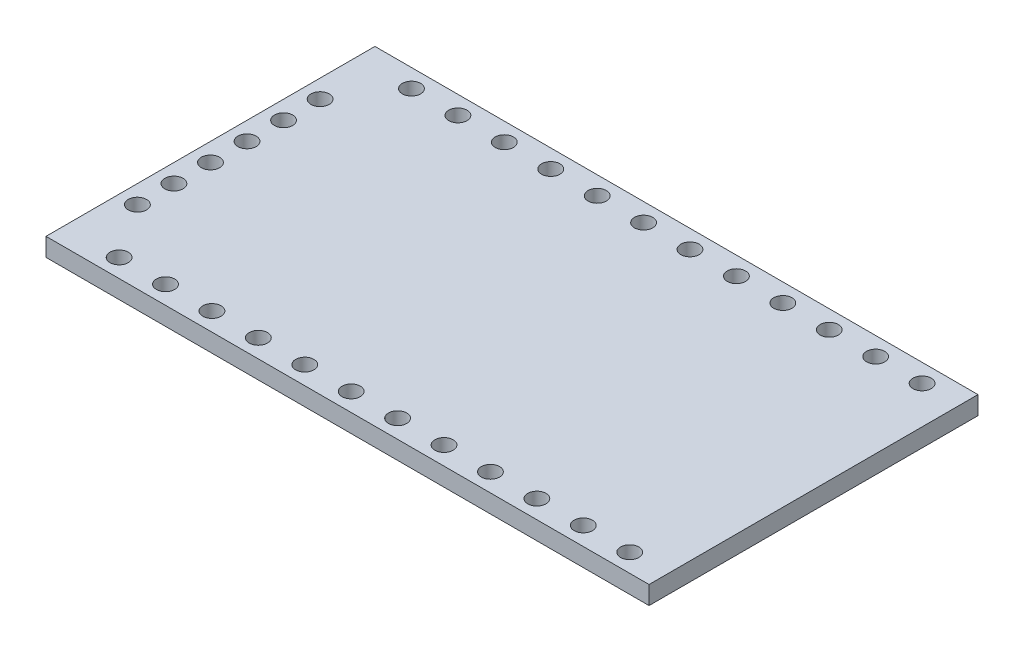
ISO-10303-21;
HEADER;
FILE_DESCRIPTION(('STEP AP214'),'2;1');
FILE_NAME('part.step','',(''),(''),'','','');
FILE_SCHEMA(('AUTOMOTIVE_DESIGN { 1 0 10303 214 1 1 1 1 }'));
ENDSEC;
DATA;
#1=APPLICATION_CONTEXT('core data for automotive mechanical design processes');
#2=APPLICATION_PROTOCOL_DEFINITION('international standard','automotive_design',2000,#1);
#3=PRODUCT_CONTEXT('',#1,'mechanical');
#4=PRODUCT('Part','Part','',(#3));
#5=PRODUCT_RELATED_PRODUCT_CATEGORY('part','',(#4));
#6=PRODUCT_DEFINITION_FORMATION('','',#4);
#7=PRODUCT_DEFINITION_CONTEXT('part definition',#1,'design');
#8=PRODUCT_DEFINITION('design','',#6,#7);
#9=PRODUCT_DEFINITION_SHAPE('','',#8);
#10=(LENGTH_UNIT() NAMED_UNIT(*) SI_UNIT(.MILLI.,.METRE.));
#11=(NAMED_UNIT(*) PLANE_ANGLE_UNIT() SI_UNIT($,.RADIAN.));
#12=(NAMED_UNIT(*) SI_UNIT($,.STERADIAN.) SOLID_ANGLE_UNIT());
#13=UNCERTAINTY_MEASURE_WITH_UNIT(LENGTH_MEASURE(1.E-05),#10,'distance_accuracy_value','');
#14=(GEOMETRIC_REPRESENTATION_CONTEXT(3) GLOBAL_UNCERTAINTY_ASSIGNED_CONTEXT((#13)) GLOBAL_UNIT_ASSIGNED_CONTEXT((#10,
#11,#12)) REPRESENTATION_CONTEXT('',''));
#15=CARTESIAN_POINT('',(0.,0.,0.));
#16=DIRECTION('',(0.,0.,1.));
#17=DIRECTION('',(1.,0.,0.));
#18=AXIS2_PLACEMENT_3D('',#15,#16,#17);
#19=CARTESIAN_POINT('',(0.,1.,0.));
#20=DIRECTION('',(0.,-1.,0.));
#21=DIRECTION('',(0.,0.,-1.));
#22=AXIS2_PLACEMENT_3D('',#19,#20,#21);
#23=PLANE('',#22);
#24=DIRECTION('',(-1.,0.,0.));
#25=VECTOR('',#24,1.);
#26=CARTESIAN_POINT('',(-23.6384959143146,1.,-9.));
#27=LINE('',#26,#25);
#28=CARTESIAN_POINT('',(9.36150408568536,1.,-9.));
#29=VERTEX_POINT('',#28);
#30=CARTESIAN_POINT('',(-23.6384959143146,1.,-9.));
#31=VERTEX_POINT('',#30);
#32=EDGE_CURVE('E84',#29,#31,#27,.T.);
#33=ORIENTED_EDGE('',*,*,#32,.T.);
#34=DIRECTION('',(0.,0.,1.));
#35=VECTOR('',#34,1.);
#36=CARTESIAN_POINT('',(-23.6384959143146,1.,9.));
#37=LINE('',#36,#35);
#38=CARTESIAN_POINT('',(-23.6384959143146,1.,9.));
#39=VERTEX_POINT('',#38);
#40=EDGE_CURVE('E79',#31,#39,#37,.T.);
#41=ORIENTED_EDGE('',*,*,#40,.T.);
#42=DIRECTION('',(1.,0.,0.));
#43=VECTOR('',#42,1.);
#44=CARTESIAN_POINT('',(-23.6384959143146,1.,9.));
#45=LINE('',#44,#43);
#46=CARTESIAN_POINT('',(9.36150408568536,1.,9.));
#47=VERTEX_POINT('',#46);
#48=EDGE_CURVE('E82',#39,#47,#45,.T.);
#49=ORIENTED_EDGE('',*,*,#48,.T.);
#50=DIRECTION('',(0.,0.,-1.));
#51=VECTOR('',#50,1.);
#52=CARTESIAN_POINT('',(9.36150408568536,1.,-9.));
#53=LINE('',#52,#51);
#54=EDGE_CURVE('E49',#47,#29,#53,.T.);
#55=ORIENTED_EDGE('',*,*,#54,.T.);
#56=EDGE_LOOP('',(#33,#41,#49,#55));
#57=FACE_BOUND('',#56,.T.);
#58=CARTESIAN_POINT('',(-22.6384959143146,1.,-1.));
#59=DIRECTION('',(0.,1.,0.));
#60=DIRECTION('',(0.,0.,1.));
#61=AXIS2_PLACEMENT_3D('',#58,#59,#60);
#62=CIRCLE('',#61,0.499999999999999);
#63=CARTESIAN_POINT('',(-22.6384959143146,1.,-0.500000000000001));
#64=VERTEX_POINT('',#63);
#65=EDGE_CURVE('E99',#64,#64,#62,.T.);
#66=ORIENTED_EDGE('',*,*,#65,.F.);
#67=EDGE_LOOP('',(#66));
#68=FACE_BOUND('',#67,.T.);
#69=CARTESIAN_POINT('',(-20.6384959143147,1.,-8.));
#70=DIRECTION('',(0.,1.,0.));
#71=DIRECTION('',(0.,0.,1.));
#72=AXIS2_PLACEMENT_3D('',#69,#70,#71);
#73=CIRCLE('',#72,0.499999999999999);
#74=CARTESIAN_POINT('',(-20.6384959143147,1.,-7.5));
#75=VERTEX_POINT('',#74);
#76=EDGE_CURVE('E114',#75,#75,#73,.T.);
#77=ORIENTED_EDGE('',*,*,#76,.F.);
#78=EDGE_LOOP('',(#77));
#79=FACE_BOUND('',#78,.T.);
#80=CARTESIAN_POINT('',(-22.6384959143146,1.,-3.));
#81=DIRECTION('',(0.,1.,0.));
#82=DIRECTION('',(0.,0.,1.));
#83=AXIS2_PLACEMENT_3D('',#80,#81,#82);
#84=CIRCLE('',#83,0.499999999999999);
#85=CARTESIAN_POINT('',(-22.6384959143146,1.,-2.5));
#86=VERTEX_POINT('',#85);
#87=EDGE_CURVE('E120',#86,#86,#84,.T.);
#88=ORIENTED_EDGE('',*,*,#87,.F.);
#89=EDGE_LOOP('',(#88));
#90=FACE_BOUND('',#89,.T.);
#91=CARTESIAN_POINT('',(-22.6384959143147,1.,-5.));
#92=DIRECTION('',(0.,1.,0.));
#93=DIRECTION('',(0.,0.,1.));
#94=AXIS2_PLACEMENT_3D('',#91,#92,#93);
#95=CIRCLE('',#94,0.499999999999999);
#96=CARTESIAN_POINT('',(-22.6384959143147,1.,-4.5));
#97=VERTEX_POINT('',#96);
#98=EDGE_CURVE('E126',#97,#97,#95,.T.);
#99=ORIENTED_EDGE('',*,*,#98,.F.);
#100=EDGE_LOOP('',(#99));
#101=FACE_BOUND('',#100,.T.);
#102=CARTESIAN_POINT('',(7.30150408568535,1.,8.));
#103=DIRECTION('',(0.,1.,0.));
#104=DIRECTION('',(0.,0.,-1.));
#105=AXIS2_PLACEMENT_3D('',#102,#103,#104);
#106=CIRCLE('',#105,0.499999999999999);
#107=CARTESIAN_POINT('',(7.30150408568535,1.,7.5));
#108=VERTEX_POINT('',#107);
#109=EDGE_CURVE('E132',#108,#108,#106,.T.);
#110=ORIENTED_EDGE('',*,*,#109,.F.);
#111=EDGE_LOOP('',(#110));
#112=FACE_BOUND('',#111,.T.);
#113=CARTESIAN_POINT('',(-18.0984959143147,1.,-8.));
#114=DIRECTION('',(0.,1.,0.));
#115=DIRECTION('',(0.,0.,1.));
#116=AXIS2_PLACEMENT_3D('',#113,#114,#115);
#117=CIRCLE('',#116,0.499999999999999);
#118=CARTESIAN_POINT('',(-18.0984959143147,1.,-7.5));
#119=VERTEX_POINT('',#118);
#120=EDGE_CURVE('E138',#119,#119,#117,.T.);
#121=ORIENTED_EDGE('',*,*,#120,.F.);
#122=EDGE_LOOP('',(#121));
#123=FACE_BOUND('',#122,.T.);
#124=CARTESIAN_POINT('',(-15.5584959143146,1.,-8.));
#125=DIRECTION('',(0.,1.,0.));
#126=DIRECTION('',(0.,0.,1.));
#127=AXIS2_PLACEMENT_3D('',#124,#125,#126);
#128=CIRCLE('',#127,0.499999999999999);
#129=CARTESIAN_POINT('',(-15.5584959143146,1.,-7.5));
#130=VERTEX_POINT('',#129);
#131=EDGE_CURVE('E144',#130,#130,#128,.T.);
#132=ORIENTED_EDGE('',*,*,#131,.F.);
#133=EDGE_LOOP('',(#132));
#134=FACE_BOUND('',#133,.T.);
#135=CARTESIAN_POINT('',(-13.0184959143147,1.,-8.));
#136=DIRECTION('',(0.,1.,0.));
#137=DIRECTION('',(0.,0.,1.));
#138=AXIS2_PLACEMENT_3D('',#135,#136,#137);
#139=CIRCLE('',#138,0.499999999999999);
#140=CARTESIAN_POINT('',(-13.0184959143147,1.,-7.5));
#141=VERTEX_POINT('',#140);
#142=EDGE_CURVE('E150',#141,#141,#139,.T.);
#143=ORIENTED_EDGE('',*,*,#142,.F.);
#144=EDGE_LOOP('',(#143));
#145=FACE_BOUND('',#144,.T.);
#146=CARTESIAN_POINT('',(-10.4784959143147,1.,-8.));
#147=DIRECTION('',(0.,1.,0.));
#148=DIRECTION('',(0.,0.,1.));
#149=AXIS2_PLACEMENT_3D('',#146,#147,#148);
#150=CIRCLE('',#149,0.499999999999999);
#151=CARTESIAN_POINT('',(-10.4784959143147,1.,-7.5));
#152=VERTEX_POINT('',#151);
#153=EDGE_CURVE('E156',#152,#152,#150,.T.);
#154=ORIENTED_EDGE('',*,*,#153,.F.);
#155=EDGE_LOOP('',(#154));
#156=FACE_BOUND('',#155,.T.);
#157=CARTESIAN_POINT('',(-7.93849591431465,1.,-8.));
#158=DIRECTION('',(0.,1.,0.));
#159=DIRECTION('',(0.,0.,1.));
#160=AXIS2_PLACEMENT_3D('',#157,#158,#159);
#161=CIRCLE('',#160,0.499999999999999);
#162=CARTESIAN_POINT('',(-7.93849591431465,1.,-7.5));
#163=VERTEX_POINT('',#162);
#164=EDGE_CURVE('E162',#163,#163,#161,.T.);
#165=ORIENTED_EDGE('',*,*,#164,.F.);
#166=EDGE_LOOP('',(#165));
#167=FACE_BOUND('',#166,.T.);
#168=CARTESIAN_POINT('',(-5.39849591431465,1.,-8.));
#169=DIRECTION('',(0.,1.,0.));
#170=DIRECTION('',(0.,0.,1.));
#171=AXIS2_PLACEMENT_3D('',#168,#169,#170);
#172=CIRCLE('',#171,0.499999999999999);
#173=CARTESIAN_POINT('',(-5.39849591431465,1.,-7.5));
#174=VERTEX_POINT('',#173);
#175=EDGE_CURVE('E168',#174,#174,#172,.T.);
#176=ORIENTED_EDGE('',*,*,#175,.F.);
#177=EDGE_LOOP('',(#176));
#178=FACE_BOUND('',#177,.T.);
#179=CARTESIAN_POINT('',(-2.85849591431465,1.,-8.));
#180=DIRECTION('',(0.,1.,0.));
#181=DIRECTION('',(0.,0.,1.));
#182=AXIS2_PLACEMENT_3D('',#179,#180,#181);
#183=CIRCLE('',#182,0.499999999999999);
#184=CARTESIAN_POINT('',(-2.85849591431465,1.,-7.5));
#185=VERTEX_POINT('',#184);
#186=EDGE_CURVE('E174',#185,#185,#183,.T.);
#187=ORIENTED_EDGE('',*,*,#186,.F.);
#188=EDGE_LOOP('',(#187));
#189=FACE_BOUND('',#188,.T.);
#190=CARTESIAN_POINT('',(-0.31849591431465,1.,-8.));
#191=DIRECTION('',(0.,1.,0.));
#192=DIRECTION('',(0.,0.,1.));
#193=AXIS2_PLACEMENT_3D('',#190,#191,#192);
#194=CIRCLE('',#193,0.499999999999999);
#195=CARTESIAN_POINT('',(-0.31849591431465,1.,-7.5));
#196=VERTEX_POINT('',#195);
#197=EDGE_CURVE('E180',#196,#196,#194,.T.);
#198=ORIENTED_EDGE('',*,*,#197,.F.);
#199=EDGE_LOOP('',(#198));
#200=FACE_BOUND('',#199,.T.);
#201=CARTESIAN_POINT('',(2.22150408568535,1.,-8.));
#202=DIRECTION('',(0.,1.,0.));
#203=DIRECTION('',(0.,0.,1.));
#204=AXIS2_PLACEMENT_3D('',#201,#202,#203);
#205=CIRCLE('',#204,0.499999999999999);
#206=CARTESIAN_POINT('',(2.22150408568535,1.,-7.5));
#207=VERTEX_POINT('',#206);
#208=EDGE_CURVE('E186',#207,#207,#205,.T.);
#209=ORIENTED_EDGE('',*,*,#208,.F.);
#210=EDGE_LOOP('',(#209));
#211=FACE_BOUND('',#210,.T.);
#212=CARTESIAN_POINT('',(4.76150408568535,1.,-8.));
#213=DIRECTION('',(0.,1.,0.));
#214=DIRECTION('',(0.,0.,1.));
#215=AXIS2_PLACEMENT_3D('',#212,#213,#214);
#216=CIRCLE('',#215,0.499999999999999);
#217=CARTESIAN_POINT('',(4.76150408568535,1.,-7.5));
#218=VERTEX_POINT('',#217);
#219=EDGE_CURVE('E192',#218,#218,#216,.T.);
#220=ORIENTED_EDGE('',*,*,#219,.F.);
#221=EDGE_LOOP('',(#220));
#222=FACE_BOUND('',#221,.T.);
#223=CARTESIAN_POINT('',(7.30150408568535,1.,-8.));
#224=DIRECTION('',(0.,1.,0.));
#225=DIRECTION('',(0.,0.,1.));
#226=AXIS2_PLACEMENT_3D('',#223,#224,#225);
#227=CIRCLE('',#226,0.499999999999999);
#228=CARTESIAN_POINT('',(7.30150408568535,1.,-7.5));
#229=VERTEX_POINT('',#228);
#230=EDGE_CURVE('E198',#229,#229,#227,.T.);
#231=ORIENTED_EDGE('',*,*,#230,.F.);
#232=EDGE_LOOP('',(#231));
#233=FACE_BOUND('',#232,.T.);
#234=CARTESIAN_POINT('',(4.76150408568535,1.,8.));
#235=DIRECTION('',(0.,1.,0.));
#236=DIRECTION('',(0.,0.,-1.));
#237=AXIS2_PLACEMENT_3D('',#234,#235,#236);
#238=CIRCLE('',#237,0.499999999999999);
#239=CARTESIAN_POINT('',(4.76150408568535,1.,7.5));
#240=VERTEX_POINT('',#239);
#241=EDGE_CURVE('E204',#240,#240,#238,.T.);
#242=ORIENTED_EDGE('',*,*,#241,.F.);
#243=EDGE_LOOP('',(#242));
#244=FACE_BOUND('',#243,.T.);
#245=CARTESIAN_POINT('',(2.22150408568535,1.,8.));
#246=DIRECTION('',(0.,1.,0.));
#247=DIRECTION('',(0.,0.,-1.));
#248=AXIS2_PLACEMENT_3D('',#245,#246,#247);
#249=CIRCLE('',#248,0.499999999999999);
#250=CARTESIAN_POINT('',(2.22150408568535,1.,7.5));
#251=VERTEX_POINT('',#250);
#252=EDGE_CURVE('E210',#251,#251,#249,.T.);
#253=ORIENTED_EDGE('',*,*,#252,.F.);
#254=EDGE_LOOP('',(#253));
#255=FACE_BOUND('',#254,.T.);
#256=CARTESIAN_POINT('',(-0.31849591431465,1.,8.));
#257=DIRECTION('',(0.,1.,0.));
#258=DIRECTION('',(0.,0.,-1.));
#259=AXIS2_PLACEMENT_3D('',#256,#257,#258);
#260=CIRCLE('',#259,0.499999999999999);
#261=CARTESIAN_POINT('',(-0.31849591431465,1.,7.5));
#262=VERTEX_POINT('',#261);
#263=EDGE_CURVE('E216',#262,#262,#260,.T.);
#264=ORIENTED_EDGE('',*,*,#263,.F.);
#265=EDGE_LOOP('',(#264));
#266=FACE_BOUND('',#265,.T.);
#267=CARTESIAN_POINT('',(-2.85849591431465,1.,8.));
#268=DIRECTION('',(0.,1.,0.));
#269=DIRECTION('',(0.,0.,-1.));
#270=AXIS2_PLACEMENT_3D('',#267,#268,#269);
#271=CIRCLE('',#270,0.499999999999999);
#272=CARTESIAN_POINT('',(-2.85849591431465,1.,7.5));
#273=VERTEX_POINT('',#272);
#274=EDGE_CURVE('E222',#273,#273,#271,.T.);
#275=ORIENTED_EDGE('',*,*,#274,.F.);
#276=EDGE_LOOP('',(#275));
#277=FACE_BOUND('',#276,.T.);
#278=CARTESIAN_POINT('',(-5.39849591431465,1.,8.));
#279=DIRECTION('',(0.,1.,0.));
#280=DIRECTION('',(0.,0.,-1.));
#281=AXIS2_PLACEMENT_3D('',#278,#279,#280);
#282=CIRCLE('',#281,0.499999999999999);
#283=CARTESIAN_POINT('',(-5.39849591431465,1.,7.5));
#284=VERTEX_POINT('',#283);
#285=EDGE_CURVE('E228',#284,#284,#282,.T.);
#286=ORIENTED_EDGE('',*,*,#285,.F.);
#287=EDGE_LOOP('',(#286));
#288=FACE_BOUND('',#287,.T.);
#289=CARTESIAN_POINT('',(-7.93849591431465,1.,8.));
#290=DIRECTION('',(0.,1.,0.));
#291=DIRECTION('',(0.,0.,-1.));
#292=AXIS2_PLACEMENT_3D('',#289,#290,#291);
#293=CIRCLE('',#292,0.499999999999999);
#294=CARTESIAN_POINT('',(-7.93849591431465,1.,7.5));
#295=VERTEX_POINT('',#294);
#296=EDGE_CURVE('E234',#295,#295,#293,.T.);
#297=ORIENTED_EDGE('',*,*,#296,.F.);
#298=EDGE_LOOP('',(#297));
#299=FACE_BOUND('',#298,.T.);
#300=CARTESIAN_POINT('',(-10.4784959143147,1.,8.));
#301=DIRECTION('',(0.,1.,0.));
#302=DIRECTION('',(0.,0.,-1.));
#303=AXIS2_PLACEMENT_3D('',#300,#301,#302);
#304=CIRCLE('',#303,0.499999999999999);
#305=CARTESIAN_POINT('',(-10.4784959143147,1.,7.5));
#306=VERTEX_POINT('',#305);
#307=EDGE_CURVE('E240',#306,#306,#304,.T.);
#308=ORIENTED_EDGE('',*,*,#307,.F.);
#309=EDGE_LOOP('',(#308));
#310=FACE_BOUND('',#309,.T.);
#311=CARTESIAN_POINT('',(-13.0184959143147,1.,8.));
#312=DIRECTION('',(0.,1.,0.));
#313=DIRECTION('',(0.,0.,-1.));
#314=AXIS2_PLACEMENT_3D('',#311,#312,#313);
#315=CIRCLE('',#314,0.499999999999999);
#316=CARTESIAN_POINT('',(-13.0184959143147,1.,7.5));
#317=VERTEX_POINT('',#316);
#318=EDGE_CURVE('E246',#317,#317,#315,.T.);
#319=ORIENTED_EDGE('',*,*,#318,.F.);
#320=EDGE_LOOP('',(#319));
#321=FACE_BOUND('',#320,.T.);
#322=CARTESIAN_POINT('',(-15.5584959143146,1.,8.));
#323=DIRECTION('',(0.,1.,0.));
#324=DIRECTION('',(0.,0.,-1.));
#325=AXIS2_PLACEMENT_3D('',#322,#323,#324);
#326=CIRCLE('',#325,0.499999999999999);
#327=CARTESIAN_POINT('',(-15.5584959143146,1.,7.5));
#328=VERTEX_POINT('',#327);
#329=EDGE_CURVE('E252',#328,#328,#326,.T.);
#330=ORIENTED_EDGE('',*,*,#329,.F.);
#331=EDGE_LOOP('',(#330));
#332=FACE_BOUND('',#331,.T.);
#333=CARTESIAN_POINT('',(-18.0984959143147,1.,8.));
#334=DIRECTION('',(0.,1.,0.));
#335=DIRECTION('',(0.,0.,-1.));
#336=AXIS2_PLACEMENT_3D('',#333,#334,#335);
#337=CIRCLE('',#336,0.499999999999999);
#338=CARTESIAN_POINT('',(-18.0984959143147,1.,7.5));
#339=VERTEX_POINT('',#338);
#340=EDGE_CURVE('E258',#339,#339,#337,.T.);
#341=ORIENTED_EDGE('',*,*,#340,.F.);
#342=EDGE_LOOP('',(#341));
#343=FACE_BOUND('',#342,.T.);
#344=CARTESIAN_POINT('',(-20.6384959143147,1.,8.));
#345=DIRECTION('',(0.,1.,0.));
#346=DIRECTION('',(0.,0.,-1.));
#347=AXIS2_PLACEMENT_3D('',#344,#345,#346);
#348=CIRCLE('',#347,0.499999999999999);
#349=CARTESIAN_POINT('',(-20.6384959143147,1.,7.5));
#350=VERTEX_POINT('',#349);
#351=EDGE_CURVE('E264',#350,#350,#348,.T.);
#352=ORIENTED_EDGE('',*,*,#351,.F.);
#353=EDGE_LOOP('',(#352));
#354=FACE_BOUND('',#353,.T.);
#355=CARTESIAN_POINT('',(-22.6384959143147,1.,5.));
#356=DIRECTION('',(0.,1.,0.));
#357=DIRECTION('',(0.,0.,-1.));
#358=AXIS2_PLACEMENT_3D('',#355,#356,#357);
#359=CIRCLE('',#358,0.499999999999999);
#360=CARTESIAN_POINT('',(-22.6384959143147,1.,4.5));
#361=VERTEX_POINT('',#360);
#362=EDGE_CURVE('E270',#361,#361,#359,.T.);
#363=ORIENTED_EDGE('',*,*,#362,.F.);
#364=EDGE_LOOP('',(#363));
#365=FACE_BOUND('',#364,.T.);
#366=CARTESIAN_POINT('',(-22.6384959143146,1.,3.));
#367=DIRECTION('',(0.,1.,0.));
#368=DIRECTION('',(0.,0.,-1.));
#369=AXIS2_PLACEMENT_3D('',#366,#367,#368);
#370=CIRCLE('',#369,0.499999999999999);
#371=CARTESIAN_POINT('',(-22.6384959143146,1.,2.5));
#372=VERTEX_POINT('',#371);
#373=EDGE_CURVE('E276',#372,#372,#370,.T.);
#374=ORIENTED_EDGE('',*,*,#373,.F.);
#375=EDGE_LOOP('',(#374));
#376=FACE_BOUND('',#375,.T.);
#377=CARTESIAN_POINT('',(-22.6384959143146,1.,1.));
#378=DIRECTION('',(0.,1.,0.));
#379=DIRECTION('',(0.,0.,-1.));
#380=AXIS2_PLACEMENT_3D('',#377,#378,#379);
#381=CIRCLE('',#380,0.499999999999999);
#382=CARTESIAN_POINT('',(-22.6384959143146,1.,0.500000000000001));
#383=VERTEX_POINT('',#382);
#384=EDGE_CURVE('E282',#383,#383,#381,.T.);
#385=ORIENTED_EDGE('',*,*,#384,.F.);
#386=EDGE_LOOP('',(#385));
#387=FACE_BOUND('',#386,.T.);
#388=ADVANCED_FACE('F32',(#57,#68,#79,#90,#101,#112,#123,#134,#145,#156,#167,#178,#189,#200,
#211,#222,#233,#244,#255,#266,#277,#288,#299,#310,#321,#332,#343,#354,#365,#376,#387),#23,.F.);
#389=CARTESIAN_POINT('',(0.,0.,0.));
#390=DIRECTION('',(0.,-1.,0.));
#391=DIRECTION('',(0.,0.,-1.));
#392=AXIS2_PLACEMENT_3D('',#389,#390,#391);
#393=PLANE('',#392);
#394=CARTESIAN_POINT('',(-22.6384959143146,0.,3.));
#395=DIRECTION('',(0.,1.,0.));
#396=DIRECTION('',(0.,0.,-1.));
#397=AXIS2_PLACEMENT_3D('',#394,#395,#396);
#398=CIRCLE('',#397,0.499999999999999);
#399=CARTESIAN_POINT('',(-22.6384959143146,0.,2.5));
#400=VERTEX_POINT('',#399);
#401=EDGE_CURVE('E279',#400,#400,#398,.T.);
#402=ORIENTED_EDGE('',*,*,#401,.T.);
#403=EDGE_LOOP('',(#402));
#404=FACE_BOUND('',#403,.T.);
#405=CARTESIAN_POINT('',(-20.6384959143147,0.,8.));
#406=DIRECTION('',(0.,1.,0.));
#407=DIRECTION('',(0.,0.,-1.));
#408=AXIS2_PLACEMENT_3D('',#405,#406,#407);
#409=CIRCLE('',#408,0.499999999999999);
#410=CARTESIAN_POINT('',(-20.6384959143147,0.,7.5));
#411=VERTEX_POINT('',#410);
#412=EDGE_CURVE('E267',#411,#411,#409,.T.);
#413=ORIENTED_EDGE('',*,*,#412,.T.);
#414=EDGE_LOOP('',(#413));
#415=FACE_BOUND('',#414,.T.);
#416=CARTESIAN_POINT('',(-15.5584959143146,0.,8.));
#417=DIRECTION('',(0.,1.,0.));
#418=DIRECTION('',(0.,0.,-1.));
#419=AXIS2_PLACEMENT_3D('',#416,#417,#418);
#420=CIRCLE('',#419,0.499999999999999);
#421=CARTESIAN_POINT('',(-15.5584959143146,0.,7.5));
#422=VERTEX_POINT('',#421);
#423=EDGE_CURVE('E255',#422,#422,#420,.T.);
#424=ORIENTED_EDGE('',*,*,#423,.T.);
#425=EDGE_LOOP('',(#424));
#426=FACE_BOUND('',#425,.T.);
#427=CARTESIAN_POINT('',(-10.4784959143147,0.,8.));
#428=DIRECTION('',(0.,1.,0.));
#429=DIRECTION('',(0.,0.,-1.));
#430=AXIS2_PLACEMENT_3D('',#427,#428,#429);
#431=CIRCLE('',#430,0.499999999999999);
#432=CARTESIAN_POINT('',(-10.4784959143147,0.,7.5));
#433=VERTEX_POINT('',#432);
#434=EDGE_CURVE('E243',#433,#433,#431,.T.);
#435=ORIENTED_EDGE('',*,*,#434,.T.);
#436=EDGE_LOOP('',(#435));
#437=FACE_BOUND('',#436,.T.);
#438=CARTESIAN_POINT('',(-5.39849591431465,0.,8.));
#439=DIRECTION('',(0.,1.,0.));
#440=DIRECTION('',(0.,0.,-1.));
#441=AXIS2_PLACEMENT_3D('',#438,#439,#440);
#442=CIRCLE('',#441,0.499999999999999);
#443=CARTESIAN_POINT('',(-5.39849591431465,0.,7.5));
#444=VERTEX_POINT('',#443);
#445=EDGE_CURVE('E231',#444,#444,#442,.T.);
#446=ORIENTED_EDGE('',*,*,#445,.T.);
#447=EDGE_LOOP('',(#446));
#448=FACE_BOUND('',#447,.T.);
#449=CARTESIAN_POINT('',(-0.31849591431465,0.,8.));
#450=DIRECTION('',(0.,1.,0.));
#451=DIRECTION('',(0.,0.,-1.));
#452=AXIS2_PLACEMENT_3D('',#449,#450,#451);
#453=CIRCLE('',#452,0.499999999999999);
#454=CARTESIAN_POINT('',(-0.31849591431465,0.,7.5));
#455=VERTEX_POINT('',#454);
#456=EDGE_CURVE('E219',#455,#455,#453,.T.);
#457=ORIENTED_EDGE('',*,*,#456,.T.);
#458=EDGE_LOOP('',(#457));
#459=FACE_BOUND('',#458,.T.);
#460=CARTESIAN_POINT('',(4.76150408568535,0.,8.));
#461=DIRECTION('',(0.,1.,0.));
#462=DIRECTION('',(0.,0.,-1.));
#463=AXIS2_PLACEMENT_3D('',#460,#461,#462);
#464=CIRCLE('',#463,0.499999999999999);
#465=CARTESIAN_POINT('',(4.76150408568535,0.,7.5));
#466=VERTEX_POINT('',#465);
#467=EDGE_CURVE('E207',#466,#466,#464,.T.);
#468=ORIENTED_EDGE('',*,*,#467,.T.);
#469=EDGE_LOOP('',(#468));
#470=FACE_BOUND('',#469,.T.);
#471=CARTESIAN_POINT('',(4.76150408568535,0.,-8.));
#472=DIRECTION('',(0.,1.,0.));
#473=DIRECTION('',(0.,0.,1.));
#474=AXIS2_PLACEMENT_3D('',#471,#472,#473);
#475=CIRCLE('',#474,0.499999999999999);
#476=CARTESIAN_POINT('',(4.76150408568535,0.,-7.5));
#477=VERTEX_POINT('',#476);
#478=EDGE_CURVE('E195',#477,#477,#475,.T.);
#479=ORIENTED_EDGE('',*,*,#478,.T.);
#480=EDGE_LOOP('',(#479));
#481=FACE_BOUND('',#480,.T.);
#482=CARTESIAN_POINT('',(-0.31849591431465,0.,-8.));
#483=DIRECTION('',(0.,1.,0.));
#484=DIRECTION('',(0.,0.,1.));
#485=AXIS2_PLACEMENT_3D('',#482,#483,#484);
#486=CIRCLE('',#485,0.499999999999999);
#487=CARTESIAN_POINT('',(-0.31849591431465,0.,-7.5));
#488=VERTEX_POINT('',#487);
#489=EDGE_CURVE('E183',#488,#488,#486,.T.);
#490=ORIENTED_EDGE('',*,*,#489,.T.);
#491=EDGE_LOOP('',(#490));
#492=FACE_BOUND('',#491,.T.);
#493=CARTESIAN_POINT('',(-5.39849591431465,0.,-8.));
#494=DIRECTION('',(0.,1.,0.));
#495=DIRECTION('',(0.,0.,1.));
#496=AXIS2_PLACEMENT_3D('',#493,#494,#495);
#497=CIRCLE('',#496,0.499999999999999);
#498=CARTESIAN_POINT('',(-5.39849591431465,0.,-7.5));
#499=VERTEX_POINT('',#498);
#500=EDGE_CURVE('E171',#499,#499,#497,.T.);
#501=ORIENTED_EDGE('',*,*,#500,.T.);
#502=EDGE_LOOP('',(#501));
#503=FACE_BOUND('',#502,.T.);
#504=CARTESIAN_POINT('',(-10.4784959143147,0.,-8.));
#505=DIRECTION('',(0.,1.,0.));
#506=DIRECTION('',(0.,0.,1.));
#507=AXIS2_PLACEMENT_3D('',#504,#505,#506);
#508=CIRCLE('',#507,0.499999999999999);
#509=CARTESIAN_POINT('',(-10.4784959143147,0.,-7.5));
#510=VERTEX_POINT('',#509);
#511=EDGE_CURVE('E159',#510,#510,#508,.T.);
#512=ORIENTED_EDGE('',*,*,#511,.T.);
#513=EDGE_LOOP('',(#512));
#514=FACE_BOUND('',#513,.T.);
#515=CARTESIAN_POINT('',(-15.5584959143146,0.,-8.));
#516=DIRECTION('',(0.,1.,0.));
#517=DIRECTION('',(0.,0.,1.));
#518=AXIS2_PLACEMENT_3D('',#515,#516,#517);
#519=CIRCLE('',#518,0.499999999999999);
#520=CARTESIAN_POINT('',(-15.5584959143146,0.,-7.5));
#521=VERTEX_POINT('',#520);
#522=EDGE_CURVE('E147',#521,#521,#519,.T.);
#523=ORIENTED_EDGE('',*,*,#522,.T.);
#524=EDGE_LOOP('',(#523));
#525=FACE_BOUND('',#524,.T.);
#526=CARTESIAN_POINT('',(7.30150408568535,0.,8.));
#527=DIRECTION('',(0.,1.,0.));
#528=DIRECTION('',(0.,0.,-1.));
#529=AXIS2_PLACEMENT_3D('',#526,#527,#528);
#530=CIRCLE('',#529,0.499999999999999);
#531=CARTESIAN_POINT('',(7.30150408568535,0.,7.5));
#532=VERTEX_POINT('',#531);
#533=EDGE_CURVE('E135',#532,#532,#530,.T.);
#534=ORIENTED_EDGE('',*,*,#533,.T.);
#535=EDGE_LOOP('',(#534));
#536=FACE_BOUND('',#535,.T.);
#537=CARTESIAN_POINT('',(-22.6384959143146,0.,-3.));
#538=DIRECTION('',(0.,1.,0.));
#539=DIRECTION('',(0.,0.,1.));
#540=AXIS2_PLACEMENT_3D('',#537,#538,#539);
#541=CIRCLE('',#540,0.499999999999999);
#542=CARTESIAN_POINT('',(-22.6384959143146,0.,-2.5));
#543=VERTEX_POINT('',#542);
#544=EDGE_CURVE('E123',#543,#543,#541,.T.);
#545=ORIENTED_EDGE('',*,*,#544,.T.);
#546=EDGE_LOOP('',(#545));
#547=FACE_BOUND('',#546,.T.);
#548=CARTESIAN_POINT('',(-22.6384959143146,0.,-1.));
#549=DIRECTION('',(0.,1.,0.));
#550=DIRECTION('',(0.,0.,1.));
#551=AXIS2_PLACEMENT_3D('',#548,#549,#550);
#552=CIRCLE('',#551,0.499999999999999);
#553=CARTESIAN_POINT('',(-22.6384959143146,0.,-0.500000000000001));
#554=VERTEX_POINT('',#553);
#555=EDGE_CURVE('E111',#554,#554,#552,.T.);
#556=ORIENTED_EDGE('',*,*,#555,.T.);
#557=EDGE_LOOP('',(#556));
#558=FACE_BOUND('',#557,.T.);
#559=DIRECTION('',(-1.,0.,0.));
#560=VECTOR('',#559,1.);
#561=CARTESIAN_POINT('',(-23.6384959143146,0.,-9.));
#562=LINE('',#561,#560);
#563=CARTESIAN_POINT('',(9.36150408568536,0.,-9.));
#564=VERTEX_POINT('',#563);
#565=CARTESIAN_POINT('',(-23.6384959143146,0.,-9.));
#566=VERTEX_POINT('',#565);
#567=EDGE_CURVE('E96',#564,#566,#562,.T.);
#568=ORIENTED_EDGE('',*,*,#567,.F.);
#569=DIRECTION('',(0.,0.,-1.));
#570=VECTOR('',#569,1.);
#571=CARTESIAN_POINT('',(9.36150408568536,0.,-9.));
#572=LINE('',#571,#570);
#573=CARTESIAN_POINT('',(9.36150408568536,0.,9.));
#574=VERTEX_POINT('',#573);
#575=EDGE_CURVE('E72',#574,#564,#572,.T.);
#576=ORIENTED_EDGE('',*,*,#575,.F.);
#577=DIRECTION('',(1.,0.,0.));
#578=VECTOR('',#577,1.);
#579=CARTESIAN_POINT('',(-23.6384959143146,0.,9.));
#580=LINE('',#579,#578);
#581=CARTESIAN_POINT('',(-23.6384959143146,0.,9.));
#582=VERTEX_POINT('',#581);
#583=EDGE_CURVE('E66',#582,#574,#580,.T.);
#584=ORIENTED_EDGE('',*,*,#583,.F.);
#585=DIRECTION('',(0.,0.,1.));
#586=VECTOR('',#585,1.);
#587=CARTESIAN_POINT('',(-23.6384959143146,0.,9.));
#588=LINE('',#587,#586);
#589=EDGE_CURVE('E88',#566,#582,#588,.T.);
#590=ORIENTED_EDGE('',*,*,#589,.F.);
#591=EDGE_LOOP('',(#568,#576,#584,#590));
#592=FACE_BOUND('',#591,.T.);
#593=CARTESIAN_POINT('',(-20.6384959143147,0.,-8.));
#594=DIRECTION('',(0.,1.,0.));
#595=DIRECTION('',(0.,0.,1.));
#596=AXIS2_PLACEMENT_3D('',#593,#594,#595);
#597=CIRCLE('',#596,0.499999999999999);
#598=CARTESIAN_POINT('',(-20.6384959143147,0.,-7.5));
#599=VERTEX_POINT('',#598);
#600=EDGE_CURVE('E117',#599,#599,#597,.T.);
#601=ORIENTED_EDGE('',*,*,#600,.T.);
#602=EDGE_LOOP('',(#601));
#603=FACE_BOUND('',#602,.T.);
#604=CARTESIAN_POINT('',(-22.6384959143147,0.,-5.));
#605=DIRECTION('',(0.,1.,0.));
#606=DIRECTION('',(0.,0.,1.));
#607=AXIS2_PLACEMENT_3D('',#604,#605,#606);
#608=CIRCLE('',#607,0.499999999999999);
#609=CARTESIAN_POINT('',(-22.6384959143147,0.,-4.5));
#610=VERTEX_POINT('',#609);
#611=EDGE_CURVE('E129',#610,#610,#608,.T.);
#612=ORIENTED_EDGE('',*,*,#611,.T.);
#613=EDGE_LOOP('',(#612));
#614=FACE_BOUND('',#613,.T.);
#615=CARTESIAN_POINT('',(-18.0984959143147,0.,-8.));
#616=DIRECTION('',(0.,1.,0.));
#617=DIRECTION('',(0.,0.,1.));
#618=AXIS2_PLACEMENT_3D('',#615,#616,#617);
#619=CIRCLE('',#618,0.499999999999999);
#620=CARTESIAN_POINT('',(-18.0984959143147,0.,-7.5));
#621=VERTEX_POINT('',#620);
#622=EDGE_CURVE('E141',#621,#621,#619,.T.);
#623=ORIENTED_EDGE('',*,*,#622,.T.);
#624=EDGE_LOOP('',(#623));
#625=FACE_BOUND('',#624,.T.);
#626=CARTESIAN_POINT('',(-13.0184959143147,0.,-8.));
#627=DIRECTION('',(0.,1.,0.));
#628=DIRECTION('',(0.,0.,1.));
#629=AXIS2_PLACEMENT_3D('',#626,#627,#628);
#630=CIRCLE('',#629,0.499999999999999);
#631=CARTESIAN_POINT('',(-13.0184959143147,0.,-7.5));
#632=VERTEX_POINT('',#631);
#633=EDGE_CURVE('E153',#632,#632,#630,.T.);
#634=ORIENTED_EDGE('',*,*,#633,.T.);
#635=EDGE_LOOP('',(#634));
#636=FACE_BOUND('',#635,.T.);
#637=CARTESIAN_POINT('',(-7.93849591431465,0.,-8.));
#638=DIRECTION('',(0.,1.,0.));
#639=DIRECTION('',(0.,0.,1.));
#640=AXIS2_PLACEMENT_3D('',#637,#638,#639);
#641=CIRCLE('',#640,0.499999999999999);
#642=CARTESIAN_POINT('',(-7.93849591431465,0.,-7.5));
#643=VERTEX_POINT('',#642);
#644=EDGE_CURVE('E165',#643,#643,#641,.T.);
#645=ORIENTED_EDGE('',*,*,#644,.T.);
#646=EDGE_LOOP('',(#645));
#647=FACE_BOUND('',#646,.T.);
#648=CARTESIAN_POINT('',(-2.85849591431465,0.,-8.));
#649=DIRECTION('',(0.,1.,0.));
#650=DIRECTION('',(0.,0.,1.));
#651=AXIS2_PLACEMENT_3D('',#648,#649,#650);
#652=CIRCLE('',#651,0.499999999999999);
#653=CARTESIAN_POINT('',(-2.85849591431465,0.,-7.5));
#654=VERTEX_POINT('',#653);
#655=EDGE_CURVE('E177',#654,#654,#652,.T.);
#656=ORIENTED_EDGE('',*,*,#655,.T.);
#657=EDGE_LOOP('',(#656));
#658=FACE_BOUND('',#657,.T.);
#659=CARTESIAN_POINT('',(2.22150408568535,0.,-8.));
#660=DIRECTION('',(0.,1.,0.));
#661=DIRECTION('',(0.,0.,1.));
#662=AXIS2_PLACEMENT_3D('',#659,#660,#661);
#663=CIRCLE('',#662,0.499999999999999);
#664=CARTESIAN_POINT('',(2.22150408568535,0.,-7.5));
#665=VERTEX_POINT('',#664);
#666=EDGE_CURVE('E189',#665,#665,#663,.T.);
#667=ORIENTED_EDGE('',*,*,#666,.T.);
#668=EDGE_LOOP('',(#667));
#669=FACE_BOUND('',#668,.T.);
#670=CARTESIAN_POINT('',(7.30150408568535,0.,-8.));
#671=DIRECTION('',(0.,1.,0.));
#672=DIRECTION('',(0.,0.,1.));
#673=AXIS2_PLACEMENT_3D('',#670,#671,#672);
#674=CIRCLE('',#673,0.499999999999999);
#675=CARTESIAN_POINT('',(7.30150408568535,0.,-7.5));
#676=VERTEX_POINT('',#675);
#677=EDGE_CURVE('E201',#676,#676,#674,.T.);
#678=ORIENTED_EDGE('',*,*,#677,.T.);
#679=EDGE_LOOP('',(#678));
#680=FACE_BOUND('',#679,.T.);
#681=CARTESIAN_POINT('',(2.22150408568535,0.,8.));
#682=DIRECTION('',(0.,1.,0.));
#683=DIRECTION('',(0.,0.,-1.));
#684=AXIS2_PLACEMENT_3D('',#681,#682,#683);
#685=CIRCLE('',#684,0.499999999999999);
#686=CARTESIAN_POINT('',(2.22150408568535,0.,7.5));
#687=VERTEX_POINT('',#686);
#688=EDGE_CURVE('E213',#687,#687,#685,.T.);
#689=ORIENTED_EDGE('',*,*,#688,.T.);
#690=EDGE_LOOP('',(#689));
#691=FACE_BOUND('',#690,.T.);
#692=CARTESIAN_POINT('',(-2.85849591431465,0.,8.));
#693=DIRECTION('',(0.,1.,0.));
#694=DIRECTION('',(0.,0.,-1.));
#695=AXIS2_PLACEMENT_3D('',#692,#693,#694);
#696=CIRCLE('',#695,0.499999999999999);
#697=CARTESIAN_POINT('',(-2.85849591431465,0.,7.5));
#698=VERTEX_POINT('',#697);
#699=EDGE_CURVE('E225',#698,#698,#696,.T.);
#700=ORIENTED_EDGE('',*,*,#699,.T.);
#701=EDGE_LOOP('',(#700));
#702=FACE_BOUND('',#701,.T.);
#703=CARTESIAN_POINT('',(-7.93849591431465,0.,8.));
#704=DIRECTION('',(0.,1.,0.));
#705=DIRECTION('',(0.,0.,-1.));
#706=AXIS2_PLACEMENT_3D('',#703,#704,#705);
#707=CIRCLE('',#706,0.499999999999999);
#708=CARTESIAN_POINT('',(-7.93849591431465,0.,7.5));
#709=VERTEX_POINT('',#708);
#710=EDGE_CURVE('E237',#709,#709,#707,.T.);
#711=ORIENTED_EDGE('',*,*,#710,.T.);
#712=EDGE_LOOP('',(#711));
#713=FACE_BOUND('',#712,.T.);
#714=CARTESIAN_POINT('',(-13.0184959143147,0.,8.));
#715=DIRECTION('',(0.,1.,0.));
#716=DIRECTION('',(0.,0.,-1.));
#717=AXIS2_PLACEMENT_3D('',#714,#715,#716);
#718=CIRCLE('',#717,0.499999999999999);
#719=CARTESIAN_POINT('',(-13.0184959143147,0.,7.5));
#720=VERTEX_POINT('',#719);
#721=EDGE_CURVE('E249',#720,#720,#718,.T.);
#722=ORIENTED_EDGE('',*,*,#721,.T.);
#723=EDGE_LOOP('',(#722));
#724=FACE_BOUND('',#723,.T.);
#725=CARTESIAN_POINT('',(-18.0984959143147,0.,8.));
#726=DIRECTION('',(0.,1.,0.));
#727=DIRECTION('',(0.,0.,-1.));
#728=AXIS2_PLACEMENT_3D('',#725,#726,#727);
#729=CIRCLE('',#728,0.499999999999999);
#730=CARTESIAN_POINT('',(-18.0984959143147,0.,7.5));
#731=VERTEX_POINT('',#730);
#732=EDGE_CURVE('E261',#731,#731,#729,.T.);
#733=ORIENTED_EDGE('',*,*,#732,.T.);
#734=EDGE_LOOP('',(#733));
#735=FACE_BOUND('',#734,.T.);
#736=CARTESIAN_POINT('',(-22.6384959143147,0.,5.));
#737=DIRECTION('',(0.,1.,0.));
#738=DIRECTION('',(0.,0.,-1.));
#739=AXIS2_PLACEMENT_3D('',#736,#737,#738);
#740=CIRCLE('',#739,0.499999999999999);
#741=CARTESIAN_POINT('',(-22.6384959143147,0.,4.5));
#742=VERTEX_POINT('',#741);
#743=EDGE_CURVE('E273',#742,#742,#740,.T.);
#744=ORIENTED_EDGE('',*,*,#743,.T.);
#745=EDGE_LOOP('',(#744));
#746=FACE_BOUND('',#745,.T.);
#747=CARTESIAN_POINT('',(-22.6384959143146,0.,1.));
#748=DIRECTION('',(0.,1.,0.));
#749=DIRECTION('',(0.,0.,-1.));
#750=AXIS2_PLACEMENT_3D('',#747,#748,#749);
#751=CIRCLE('',#750,0.499999999999999);
#752=CARTESIAN_POINT('',(-22.6384959143146,0.,0.500000000000001));
#753=VERTEX_POINT('',#752);
#754=EDGE_CURVE('E285',#753,#753,#751,.T.);
#755=ORIENTED_EDGE('',*,*,#754,.T.);
#756=EDGE_LOOP('',(#755));
#757=FACE_BOUND('',#756,.T.);
#758=ADVANCED_FACE('F107',(#404,#415,#426,#437,#448,#459,#470,#481,#492,#503,#514,#525,#536,
#547,#558,#592,#603,#614,#625,#636,#647,#658,#669,#680,#691,#702,#713,#724,#735,#746,#757),#393,.T.);
#759=CARTESIAN_POINT('',(-23.6384959143146,1.,-9.));
#760=DIRECTION('',(0.,0.,1.));
#761=DIRECTION('',(1.,0.,0.));
#762=AXIS2_PLACEMENT_3D('',#759,#760,#761);
#763=PLANE('',#762);
#764=ORIENTED_EDGE('',*,*,#567,.T.);
#765=DIRECTION('',(0.,-1.,0.));
#766=VECTOR('',#765,1.);
#767=CARTESIAN_POINT('',(-23.6384959143146,1.,-9.));
#768=LINE('',#767,#766);
#769=EDGE_CURVE('E11',#31,#566,#768,.T.);
#770=ORIENTED_EDGE('',*,*,#769,.F.);
#771=ORIENTED_EDGE('',*,*,#32,.F.);
#772=DIRECTION('',(0.,-1.,0.));
#773=VECTOR('',#772,1.);
#774=CARTESIAN_POINT('',(9.36150408568536,1.,-9.));
#775=LINE('',#774,#773);
#776=EDGE_CURVE('E92',#29,#564,#775,.T.);
#777=ORIENTED_EDGE('',*,*,#776,.T.);
#778=EDGE_LOOP('',(#764,#770,#771,#777));
#779=FACE_BOUND('',#778,.T.);
#780=ADVANCED_FACE('F34',(#779),#763,.F.);
#781=CARTESIAN_POINT('',(-23.6384959143146,1.,9.));
#782=DIRECTION('',(1.,0.,0.));
#783=DIRECTION('',(0.,0.,-1.));
#784=AXIS2_PLACEMENT_3D('',#781,#782,#783);
#785=PLANE('',#784);
#786=ORIENTED_EDGE('',*,*,#589,.T.);
#787=DIRECTION('',(0.,-1.,0.));
#788=VECTOR('',#787,1.);
#789=CARTESIAN_POINT('',(-23.6384959143146,1.,9.));
#790=LINE('',#789,#788);
#791=EDGE_CURVE('E41',#39,#582,#790,.T.);
#792=ORIENTED_EDGE('',*,*,#791,.F.);
#793=ORIENTED_EDGE('',*,*,#40,.F.);
#794=ORIENTED_EDGE('',*,*,#769,.T.);
#795=EDGE_LOOP('',(#786,#792,#793,#794));
#796=FACE_BOUND('',#795,.T.);
#797=ADVANCED_FACE('F87',(#796),#785,.F.);
#798=CARTESIAN_POINT('',(-23.6384959143146,1.,9.));
#799=DIRECTION('',(0.,0.,-1.));
#800=DIRECTION('',(-1.,0.,0.));
#801=AXIS2_PLACEMENT_3D('',#798,#799,#800);
#802=PLANE('',#801);
#803=ORIENTED_EDGE('',*,*,#583,.T.);
#804=DIRECTION('',(0.,-1.,0.));
#805=VECTOR('',#804,1.);
#806=CARTESIAN_POINT('',(9.36150408568536,1.,9.));
#807=LINE('',#806,#805);
#808=EDGE_CURVE('E89',#47,#574,#807,.T.);
#809=ORIENTED_EDGE('',*,*,#808,.F.);
#810=ORIENTED_EDGE('',*,*,#48,.F.);
#811=ORIENTED_EDGE('',*,*,#791,.T.);
#812=EDGE_LOOP('',(#803,#809,#810,#811));
#813=FACE_BOUND('',#812,.T.);
#814=ADVANCED_FACE('F90',(#813),#802,.F.);
#815=CARTESIAN_POINT('',(9.36150408568536,1.,-9.));
#816=DIRECTION('',(-1.,0.,0.));
#817=DIRECTION('',(0.,0.,1.));
#818=AXIS2_PLACEMENT_3D('',#815,#816,#817);
#819=PLANE('',#818);
#820=ORIENTED_EDGE('',*,*,#575,.T.);
#821=ORIENTED_EDGE('',*,*,#776,.F.);
#822=ORIENTED_EDGE('',*,*,#54,.F.);
#823=ORIENTED_EDGE('',*,*,#808,.T.);
#824=EDGE_LOOP('',(#820,#821,#822,#823));
#825=FACE_BOUND('',#824,.T.);
#826=ADVANCED_FACE('F104',(#825),#819,.F.);
#827=CARTESIAN_POINT('',(-22.6384959143146,1.,-1.));
#828=DIRECTION('',(0.,-1.,0.));
#829=DIRECTION('',(0.,0.,-1.));
#830=AXIS2_PLACEMENT_3D('',#827,#828,#829);
#831=CYLINDRICAL_SURFACE('',#830,0.499999999999999);
#832=ORIENTED_EDGE('',*,*,#65,.T.);
#833=EDGE_LOOP('',(#832));
#834=FACE_BOUND('',#833,.T.);
#835=ORIENTED_EDGE('',*,*,#555,.F.);
#836=EDGE_LOOP('',(#835));
#837=FACE_BOUND('',#836,.T.);
#838=ADVANCED_FACE('F302',(#834,#837),#831,.F.);
#839=CARTESIAN_POINT('',(-20.6384959143147,1.,-8.));
#840=DIRECTION('',(0.,-1.,0.));
#841=DIRECTION('',(0.,0.,-1.));
#842=AXIS2_PLACEMENT_3D('',#839,#840,#841);
#843=CYLINDRICAL_SURFACE('',#842,0.499999999999999);
#844=ORIENTED_EDGE('',*,*,#76,.T.);
#845=EDGE_LOOP('',(#844));
#846=FACE_BOUND('',#845,.T.);
#847=ORIENTED_EDGE('',*,*,#600,.F.);
#848=EDGE_LOOP('',(#847));
#849=FACE_BOUND('',#848,.T.);
#850=ADVANCED_FACE('F348',(#846,#849),#843,.F.);
#851=CARTESIAN_POINT('',(-22.6384959143146,1.,-3.));
#852=DIRECTION('',(0.,-1.,0.));
#853=DIRECTION('',(0.,0.,-1.));
#854=AXIS2_PLACEMENT_3D('',#851,#852,#853);
#855=CYLINDRICAL_SURFACE('',#854,0.499999999999999);
#856=ORIENTED_EDGE('',*,*,#87,.T.);
#857=EDGE_LOOP('',(#856));
#858=FACE_BOUND('',#857,.T.);
#859=ORIENTED_EDGE('',*,*,#544,.F.);
#860=EDGE_LOOP('',(#859));
#861=FACE_BOUND('',#860,.T.);
#862=ADVANCED_FACE('F356',(#858,#861),#855,.F.);
#863=CARTESIAN_POINT('',(-22.6384959143147,1.,-5.));
#864=DIRECTION('',(0.,-1.,0.));
#865=DIRECTION('',(0.,0.,-1.));
#866=AXIS2_PLACEMENT_3D('',#863,#864,#865);
#867=CYLINDRICAL_SURFACE('',#866,0.499999999999999);
#868=ORIENTED_EDGE('',*,*,#98,.T.);
#869=EDGE_LOOP('',(#868));
#870=FACE_BOUND('',#869,.T.);
#871=ORIENTED_EDGE('',*,*,#611,.F.);
#872=EDGE_LOOP('',(#871));
#873=FACE_BOUND('',#872,.T.);
#874=ADVANCED_FACE('F364',(#870,#873),#867,.F.);
#875=CARTESIAN_POINT('',(7.30150408568535,1.,8.));
#876=DIRECTION('',(0.,-1.,0.));
#877=DIRECTION('',(0.,0.,-1.));
#878=AXIS2_PLACEMENT_3D('',#875,#876,#877);
#879=CYLINDRICAL_SURFACE('',#878,0.499999999999999);
#880=ORIENTED_EDGE('',*,*,#109,.T.);
#881=EDGE_LOOP('',(#880));
#882=FACE_BOUND('',#881,.T.);
#883=ORIENTED_EDGE('',*,*,#533,.F.);
#884=EDGE_LOOP('',(#883));
#885=FACE_BOUND('',#884,.T.);
#886=ADVANCED_FACE('F373',(#882,#885),#879,.F.);
#887=CARTESIAN_POINT('',(-18.0984959143147,1.,-8.));
#888=DIRECTION('',(0.,-1.,0.));
#889=DIRECTION('',(0.,0.,-1.));
#890=AXIS2_PLACEMENT_3D('',#887,#888,#889);
#891=CYLINDRICAL_SURFACE('',#890,0.499999999999999);
#892=ORIENTED_EDGE('',*,*,#120,.T.);
#893=EDGE_LOOP('',(#892));
#894=FACE_BOUND('',#893,.T.);
#895=ORIENTED_EDGE('',*,*,#622,.F.);
#896=EDGE_LOOP('',(#895));
#897=FACE_BOUND('',#896,.T.);
#898=ADVANCED_FACE('F382',(#894,#897),#891,.F.);
#899=CARTESIAN_POINT('',(-15.5584959143146,1.,-8.));
#900=DIRECTION('',(0.,-1.,0.));
#901=DIRECTION('',(0.,0.,-1.));
#902=AXIS2_PLACEMENT_3D('',#899,#900,#901);
#903=CYLINDRICAL_SURFACE('',#902,0.499999999999999);
#904=ORIENTED_EDGE('',*,*,#131,.T.);
#905=EDGE_LOOP('',(#904));
#906=FACE_BOUND('',#905,.T.);
#907=ORIENTED_EDGE('',*,*,#522,.F.);
#908=EDGE_LOOP('',(#907));
#909=FACE_BOUND('',#908,.T.);
#910=ADVANCED_FACE('F391',(#906,#909),#903,.F.);
#911=CARTESIAN_POINT('',(-13.0184959143147,1.,-8.));
#912=DIRECTION('',(0.,-1.,0.));
#913=DIRECTION('',(0.,0.,-1.));
#914=AXIS2_PLACEMENT_3D('',#911,#912,#913);
#915=CYLINDRICAL_SURFACE('',#914,0.499999999999999);
#916=ORIENTED_EDGE('',*,*,#142,.T.);
#917=EDGE_LOOP('',(#916));
#918=FACE_BOUND('',#917,.T.);
#919=ORIENTED_EDGE('',*,*,#633,.F.);
#920=EDGE_LOOP('',(#919));
#921=FACE_BOUND('',#920,.T.);
#922=ADVANCED_FACE('F400',(#918,#921),#915,.F.);
#923=CARTESIAN_POINT('',(-10.4784959143147,1.,-8.));
#924=DIRECTION('',(0.,-1.,0.));
#925=DIRECTION('',(0.,0.,-1.));
#926=AXIS2_PLACEMENT_3D('',#923,#924,#925);
#927=CYLINDRICAL_SURFACE('',#926,0.499999999999999);
#928=ORIENTED_EDGE('',*,*,#153,.T.);
#929=EDGE_LOOP('',(#928));
#930=FACE_BOUND('',#929,.T.);
#931=ORIENTED_EDGE('',*,*,#511,.F.);
#932=EDGE_LOOP('',(#931));
#933=FACE_BOUND('',#932,.T.);
#934=ADVANCED_FACE('F409',(#930,#933),#927,.F.);
#935=CARTESIAN_POINT('',(-7.93849591431465,1.,-8.));
#936=DIRECTION('',(0.,-1.,0.));
#937=DIRECTION('',(0.,0.,-1.));
#938=AXIS2_PLACEMENT_3D('',#935,#936,#937);
#939=CYLINDRICAL_SURFACE('',#938,0.499999999999999);
#940=ORIENTED_EDGE('',*,*,#164,.T.);
#941=EDGE_LOOP('',(#940));
#942=FACE_BOUND('',#941,.T.);
#943=ORIENTED_EDGE('',*,*,#644,.F.);
#944=EDGE_LOOP('',(#943));
#945=FACE_BOUND('',#944,.T.);
#946=ADVANCED_FACE('F418',(#942,#945),#939,.F.);
#947=CARTESIAN_POINT('',(-5.39849591431465,1.,-8.));
#948=DIRECTION('',(0.,-1.,0.));
#949=DIRECTION('',(0.,0.,-1.));
#950=AXIS2_PLACEMENT_3D('',#947,#948,#949);
#951=CYLINDRICAL_SURFACE('',#950,0.499999999999999);
#952=ORIENTED_EDGE('',*,*,#175,.T.);
#953=EDGE_LOOP('',(#952));
#954=FACE_BOUND('',#953,.T.);
#955=ORIENTED_EDGE('',*,*,#500,.F.);
#956=EDGE_LOOP('',(#955));
#957=FACE_BOUND('',#956,.T.);
#958=ADVANCED_FACE('F427',(#954,#957),#951,.F.);
#959=CARTESIAN_POINT('',(-2.85849591431465,1.,-8.));
#960=DIRECTION('',(0.,-1.,0.));
#961=DIRECTION('',(0.,0.,-1.));
#962=AXIS2_PLACEMENT_3D('',#959,#960,#961);
#963=CYLINDRICAL_SURFACE('',#962,0.499999999999999);
#964=ORIENTED_EDGE('',*,*,#186,.T.);
#965=EDGE_LOOP('',(#964));
#966=FACE_BOUND('',#965,.T.);
#967=ORIENTED_EDGE('',*,*,#655,.F.);
#968=EDGE_LOOP('',(#967));
#969=FACE_BOUND('',#968,.T.);
#970=ADVANCED_FACE('F436',(#966,#969),#963,.F.);
#971=CARTESIAN_POINT('',(-0.31849591431465,1.,-8.));
#972=DIRECTION('',(0.,-1.,0.));
#973=DIRECTION('',(0.,0.,-1.));
#974=AXIS2_PLACEMENT_3D('',#971,#972,#973);
#975=CYLINDRICAL_SURFACE('',#974,0.499999999999999);
#976=ORIENTED_EDGE('',*,*,#197,.T.);
#977=EDGE_LOOP('',(#976));
#978=FACE_BOUND('',#977,.T.);
#979=ORIENTED_EDGE('',*,*,#489,.F.);
#980=EDGE_LOOP('',(#979));
#981=FACE_BOUND('',#980,.T.);
#982=ADVANCED_FACE('F445',(#978,#981),#975,.F.);
#983=CARTESIAN_POINT('',(2.22150408568535,1.,-8.));
#984=DIRECTION('',(0.,-1.,0.));
#985=DIRECTION('',(0.,0.,-1.));
#986=AXIS2_PLACEMENT_3D('',#983,#984,#985);
#987=CYLINDRICAL_SURFACE('',#986,0.499999999999999);
#988=ORIENTED_EDGE('',*,*,#208,.T.);
#989=EDGE_LOOP('',(#988));
#990=FACE_BOUND('',#989,.T.);
#991=ORIENTED_EDGE('',*,*,#666,.F.);
#992=EDGE_LOOP('',(#991));
#993=FACE_BOUND('',#992,.T.);
#994=ADVANCED_FACE('F454',(#990,#993),#987,.F.);
#995=CARTESIAN_POINT('',(4.76150408568535,1.,-8.));
#996=DIRECTION('',(0.,-1.,0.));
#997=DIRECTION('',(0.,0.,-1.));
#998=AXIS2_PLACEMENT_3D('',#995,#996,#997);
#999=CYLINDRICAL_SURFACE('',#998,0.499999999999999);
#1000=ORIENTED_EDGE('',*,*,#219,.T.);
#1001=EDGE_LOOP('',(#1000));
#1002=FACE_BOUND('',#1001,.T.);
#1003=ORIENTED_EDGE('',*,*,#478,.F.);
#1004=EDGE_LOOP('',(#1003));
#1005=FACE_BOUND('',#1004,.T.);
#1006=ADVANCED_FACE('F463',(#1002,#1005),#999,.F.);
#1007=CARTESIAN_POINT('',(7.30150408568535,1.,-8.));
#1008=DIRECTION('',(0.,-1.,0.));
#1009=DIRECTION('',(0.,0.,-1.));
#1010=AXIS2_PLACEMENT_3D('',#1007,#1008,#1009);
#1011=CYLINDRICAL_SURFACE('',#1010,0.499999999999999);
#1012=ORIENTED_EDGE('',*,*,#230,.T.);
#1013=EDGE_LOOP('',(#1012));
#1014=FACE_BOUND('',#1013,.T.);
#1015=ORIENTED_EDGE('',*,*,#677,.F.);
#1016=EDGE_LOOP('',(#1015));
#1017=FACE_BOUND('',#1016,.T.);
#1018=ADVANCED_FACE('F472',(#1014,#1017),#1011,.F.);
#1019=CARTESIAN_POINT('',(4.76150408568535,1.,8.));
#1020=DIRECTION('',(0.,-1.,0.));
#1021=DIRECTION('',(0.,0.,-1.));
#1022=AXIS2_PLACEMENT_3D('',#1019,#1020,#1021);
#1023=CYLINDRICAL_SURFACE('',#1022,0.499999999999999);
#1024=ORIENTED_EDGE('',*,*,#241,.T.);
#1025=EDGE_LOOP('',(#1024));
#1026=FACE_BOUND('',#1025,.T.);
#1027=ORIENTED_EDGE('',*,*,#467,.F.);
#1028=EDGE_LOOP('',(#1027));
#1029=FACE_BOUND('',#1028,.T.);
#1030=ADVANCED_FACE('F481',(#1026,#1029),#1023,.F.);
#1031=CARTESIAN_POINT('',(2.22150408568535,1.,8.));
#1032=DIRECTION('',(0.,-1.,0.));
#1033=DIRECTION('',(0.,0.,-1.));
#1034=AXIS2_PLACEMENT_3D('',#1031,#1032,#1033);
#1035=CYLINDRICAL_SURFACE('',#1034,0.499999999999999);
#1036=ORIENTED_EDGE('',*,*,#252,.T.);
#1037=EDGE_LOOP('',(#1036));
#1038=FACE_BOUND('',#1037,.T.);
#1039=ORIENTED_EDGE('',*,*,#688,.F.);
#1040=EDGE_LOOP('',(#1039));
#1041=FACE_BOUND('',#1040,.T.);
#1042=ADVANCED_FACE('F490',(#1038,#1041),#1035,.F.);
#1043=CARTESIAN_POINT('',(-0.31849591431465,1.,8.));
#1044=DIRECTION('',(0.,-1.,0.));
#1045=DIRECTION('',(0.,0.,-1.));
#1046=AXIS2_PLACEMENT_3D('',#1043,#1044,#1045);
#1047=CYLINDRICAL_SURFACE('',#1046,0.499999999999999);
#1048=ORIENTED_EDGE('',*,*,#263,.T.);
#1049=EDGE_LOOP('',(#1048));
#1050=FACE_BOUND('',#1049,.T.);
#1051=ORIENTED_EDGE('',*,*,#456,.F.);
#1052=EDGE_LOOP('',(#1051));
#1053=FACE_BOUND('',#1052,.T.);
#1054=ADVANCED_FACE('F499',(#1050,#1053),#1047,.F.);
#1055=CARTESIAN_POINT('',(-2.85849591431465,1.,8.));
#1056=DIRECTION('',(0.,-1.,0.));
#1057=DIRECTION('',(0.,0.,-1.));
#1058=AXIS2_PLACEMENT_3D('',#1055,#1056,#1057);
#1059=CYLINDRICAL_SURFACE('',#1058,0.499999999999999);
#1060=ORIENTED_EDGE('',*,*,#274,.T.);
#1061=EDGE_LOOP('',(#1060));
#1062=FACE_BOUND('',#1061,.T.);
#1063=ORIENTED_EDGE('',*,*,#699,.F.);
#1064=EDGE_LOOP('',(#1063));
#1065=FACE_BOUND('',#1064,.T.);
#1066=ADVANCED_FACE('F508',(#1062,#1065),#1059,.F.);
#1067=CARTESIAN_POINT('',(-5.39849591431465,1.,8.));
#1068=DIRECTION('',(0.,-1.,0.));
#1069=DIRECTION('',(0.,0.,-1.));
#1070=AXIS2_PLACEMENT_3D('',#1067,#1068,#1069);
#1071=CYLINDRICAL_SURFACE('',#1070,0.499999999999999);
#1072=ORIENTED_EDGE('',*,*,#285,.T.);
#1073=EDGE_LOOP('',(#1072));
#1074=FACE_BOUND('',#1073,.T.);
#1075=ORIENTED_EDGE('',*,*,#445,.F.);
#1076=EDGE_LOOP('',(#1075));
#1077=FACE_BOUND('',#1076,.T.);
#1078=ADVANCED_FACE('F517',(#1074,#1077),#1071,.F.);
#1079=CARTESIAN_POINT('',(-7.93849591431465,1.,8.));
#1080=DIRECTION('',(0.,-1.,0.));
#1081=DIRECTION('',(0.,0.,-1.));
#1082=AXIS2_PLACEMENT_3D('',#1079,#1080,#1081);
#1083=CYLINDRICAL_SURFACE('',#1082,0.499999999999999);
#1084=ORIENTED_EDGE('',*,*,#296,.T.);
#1085=EDGE_LOOP('',(#1084));
#1086=FACE_BOUND('',#1085,.T.);
#1087=ORIENTED_EDGE('',*,*,#710,.F.);
#1088=EDGE_LOOP('',(#1087));
#1089=FACE_BOUND('',#1088,.T.);
#1090=ADVANCED_FACE('F526',(#1086,#1089),#1083,.F.);
#1091=CARTESIAN_POINT('',(-10.4784959143147,1.,8.));
#1092=DIRECTION('',(0.,-1.,0.));
#1093=DIRECTION('',(0.,0.,-1.));
#1094=AXIS2_PLACEMENT_3D('',#1091,#1092,#1093);
#1095=CYLINDRICAL_SURFACE('',#1094,0.499999999999999);
#1096=ORIENTED_EDGE('',*,*,#307,.T.);
#1097=EDGE_LOOP('',(#1096));
#1098=FACE_BOUND('',#1097,.T.);
#1099=ORIENTED_EDGE('',*,*,#434,.F.);
#1100=EDGE_LOOP('',(#1099));
#1101=FACE_BOUND('',#1100,.T.);
#1102=ADVANCED_FACE('F535',(#1098,#1101),#1095,.F.);
#1103=CARTESIAN_POINT('',(-13.0184959143147,1.,8.));
#1104=DIRECTION('',(0.,-1.,0.));
#1105=DIRECTION('',(0.,0.,-1.));
#1106=AXIS2_PLACEMENT_3D('',#1103,#1104,#1105);
#1107=CYLINDRICAL_SURFACE('',#1106,0.499999999999999);
#1108=ORIENTED_EDGE('',*,*,#318,.T.);
#1109=EDGE_LOOP('',(#1108));
#1110=FACE_BOUND('',#1109,.T.);
#1111=ORIENTED_EDGE('',*,*,#721,.F.);
#1112=EDGE_LOOP('',(#1111));
#1113=FACE_BOUND('',#1112,.T.);
#1114=ADVANCED_FACE('F544',(#1110,#1113),#1107,.F.);
#1115=CARTESIAN_POINT('',(-15.5584959143146,1.,8.));
#1116=DIRECTION('',(0.,-1.,0.));
#1117=DIRECTION('',(0.,0.,-1.));
#1118=AXIS2_PLACEMENT_3D('',#1115,#1116,#1117);
#1119=CYLINDRICAL_SURFACE('',#1118,0.499999999999999);
#1120=ORIENTED_EDGE('',*,*,#329,.T.);
#1121=EDGE_LOOP('',(#1120));
#1122=FACE_BOUND('',#1121,.T.);
#1123=ORIENTED_EDGE('',*,*,#423,.F.);
#1124=EDGE_LOOP('',(#1123));
#1125=FACE_BOUND('',#1124,.T.);
#1126=ADVANCED_FACE('F553',(#1122,#1125),#1119,.F.);
#1127=CARTESIAN_POINT('',(-18.0984959143147,1.,8.));
#1128=DIRECTION('',(0.,-1.,0.));
#1129=DIRECTION('',(0.,0.,-1.));
#1130=AXIS2_PLACEMENT_3D('',#1127,#1128,#1129);
#1131=CYLINDRICAL_SURFACE('',#1130,0.499999999999999);
#1132=ORIENTED_EDGE('',*,*,#340,.T.);
#1133=EDGE_LOOP('',(#1132));
#1134=FACE_BOUND('',#1133,.T.);
#1135=ORIENTED_EDGE('',*,*,#732,.F.);
#1136=EDGE_LOOP('',(#1135));
#1137=FACE_BOUND('',#1136,.T.);
#1138=ADVANCED_FACE('F562',(#1134,#1137),#1131,.F.);
#1139=CARTESIAN_POINT('',(-20.6384959143147,1.,8.));
#1140=DIRECTION('',(0.,-1.,0.));
#1141=DIRECTION('',(0.,0.,-1.));
#1142=AXIS2_PLACEMENT_3D('',#1139,#1140,#1141);
#1143=CYLINDRICAL_SURFACE('',#1142,0.499999999999999);
#1144=ORIENTED_EDGE('',*,*,#351,.T.);
#1145=EDGE_LOOP('',(#1144));
#1146=FACE_BOUND('',#1145,.T.);
#1147=ORIENTED_EDGE('',*,*,#412,.F.);
#1148=EDGE_LOOP('',(#1147));
#1149=FACE_BOUND('',#1148,.T.);
#1150=ADVANCED_FACE('F571',(#1146,#1149),#1143,.F.);
#1151=CARTESIAN_POINT('',(-22.6384959143147,1.,5.));
#1152=DIRECTION('',(0.,-1.,0.));
#1153=DIRECTION('',(0.,0.,-1.));
#1154=AXIS2_PLACEMENT_3D('',#1151,#1152,#1153);
#1155=CYLINDRICAL_SURFACE('',#1154,0.499999999999999);
#1156=ORIENTED_EDGE('',*,*,#362,.T.);
#1157=EDGE_LOOP('',(#1156));
#1158=FACE_BOUND('',#1157,.T.);
#1159=ORIENTED_EDGE('',*,*,#743,.F.);
#1160=EDGE_LOOP('',(#1159));
#1161=FACE_BOUND('',#1160,.T.);
#1162=ADVANCED_FACE('F580',(#1158,#1161),#1155,.F.);
#1163=CARTESIAN_POINT('',(-22.6384959143146,1.,3.));
#1164=DIRECTION('',(0.,-1.,0.));
#1165=DIRECTION('',(0.,0.,-1.));
#1166=AXIS2_PLACEMENT_3D('',#1163,#1164,#1165);
#1167=CYLINDRICAL_SURFACE('',#1166,0.499999999999999);
#1168=ORIENTED_EDGE('',*,*,#373,.T.);
#1169=EDGE_LOOP('',(#1168));
#1170=FACE_BOUND('',#1169,.T.);
#1171=ORIENTED_EDGE('',*,*,#401,.F.);
#1172=EDGE_LOOP('',(#1171));
#1173=FACE_BOUND('',#1172,.T.);
#1174=ADVANCED_FACE('F589',(#1170,#1173),#1167,.F.);
#1175=CARTESIAN_POINT('',(-22.6384959143146,1.,1.));
#1176=DIRECTION('',(0.,-1.,0.));
#1177=DIRECTION('',(0.,0.,-1.));
#1178=AXIS2_PLACEMENT_3D('',#1175,#1176,#1177);
#1179=CYLINDRICAL_SURFACE('',#1178,0.499999999999999);
#1180=ORIENTED_EDGE('',*,*,#384,.T.);
#1181=EDGE_LOOP('',(#1180));
#1182=FACE_BOUND('',#1181,.T.);
#1183=ORIENTED_EDGE('',*,*,#754,.F.);
#1184=EDGE_LOOP('',(#1183));
#1185=FACE_BOUND('',#1184,.T.);
#1186=ADVANCED_FACE('F291',(#1182,#1185),#1179,.F.);
#1187=CLOSED_SHELL('',(#388,#758,#780,#797,#814,#826,#838,#850,#862,#874,#886,#898,#910,#922,
#934,#946,#958,#970,#982,#994,#1006,#1018,#1030,#1042,#1054,#1066,#1078,#1090,#1102,#1114,#1126,
#1138,#1150,#1162,#1174,#1186));
#1188=MANIFOLD_SOLID_BREP('B2',#1187);
#1189=ADVANCED_BREP_SHAPE_REPRESENTATION('',(#18,#1188),#14);
#1190=SHAPE_DEFINITION_REPRESENTATION(#9,#1189);
ENDSEC;
END-ISO-10303-21;
